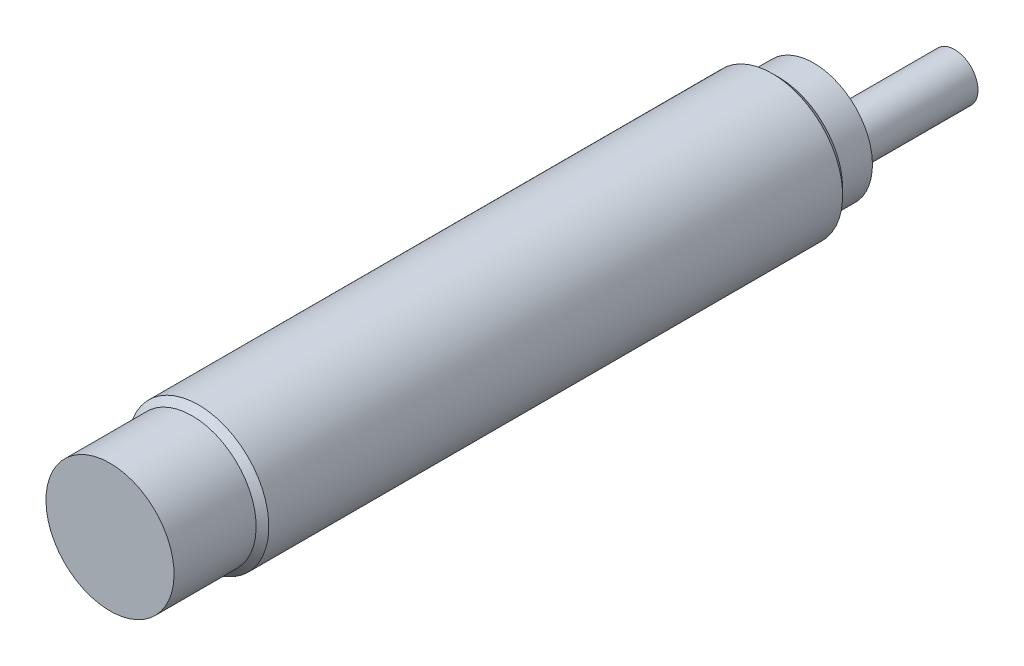
ISO-10303-21;
HEADER;
FILE_DESCRIPTION(('STEP AP214'),'2;1');
FILE_NAME('part.step','',(''),(''),'','','');
FILE_SCHEMA(('AUTOMOTIVE_DESIGN { 1 0 10303 214 1 1 1 1 }'));
ENDSEC;
DATA;
#1=APPLICATION_CONTEXT('core data for automotive mechanical design processes');
#2=APPLICATION_PROTOCOL_DEFINITION('international standard','automotive_design',2000,#1);
#3=PRODUCT_CONTEXT('',#1,'mechanical');
#4=PRODUCT('Part','Part','',(#3));
#5=PRODUCT_RELATED_PRODUCT_CATEGORY('part','',(#4));
#6=PRODUCT_DEFINITION_FORMATION('','',#4);
#7=PRODUCT_DEFINITION_CONTEXT('part definition',#1,'design');
#8=PRODUCT_DEFINITION('design','',#6,#7);
#9=PRODUCT_DEFINITION_SHAPE('','',#8);
#10=(LENGTH_UNIT() NAMED_UNIT(*) SI_UNIT(.MILLI.,.METRE.));
#11=(NAMED_UNIT(*) PLANE_ANGLE_UNIT() SI_UNIT($,.RADIAN.));
#12=(NAMED_UNIT(*) SI_UNIT($,.STERADIAN.) SOLID_ANGLE_UNIT());
#13=UNCERTAINTY_MEASURE_WITH_UNIT(LENGTH_MEASURE(1.E-05),#10,'distance_accuracy_value','');
#14=(GEOMETRIC_REPRESENTATION_CONTEXT(3) GLOBAL_UNCERTAINTY_ASSIGNED_CONTEXT((#13)) GLOBAL_UNIT_ASSIGNED_CONTEXT((#10,
#11,#12)) REPRESENTATION_CONTEXT('',''));
#15=CARTESIAN_POINT('',(0.,0.,0.));
#16=DIRECTION('',(0.,0.,1.));
#17=DIRECTION('',(1.,0.,0.));
#18=AXIS2_PLACEMENT_3D('',#15,#16,#17);
#19=CARTESIAN_POINT('',(0.,5.45875,0.));
#20=DIRECTION('',(0.,0.,1.));
#21=DIRECTION('',(1.,0.,0.));
#22=AXIS2_PLACEMENT_3D('',#19,#20,#21);
#23=PLANE('',#22);
#24=CARTESIAN_POINT('',(0.,0.,0.));
#25=DIRECTION('',(0.,0.,1.));
#26=DIRECTION('',(1.,0.,0.));
#27=AXIS2_PLACEMENT_3D('',#24,#25,#26);
#28=CIRCLE('',#27,5.);
#29=CARTESIAN_POINT('',(5.,0.,0.));
#30=VERTEX_POINT('',#29);
#31=EDGE_CURVE('E45',#30,#30,#28,.T.);
#32=ORIENTED_EDGE('',*,*,#31,.T.);
#33=EDGE_LOOP('',(#32));
#34=FACE_BOUND('',#33,.T.);
#35=CARTESIAN_POINT('',(0.,0.,0.));
#36=DIRECTION('',(0.,0.,-1.));
#37=DIRECTION('',(-1.,0.,0.));
#38=AXIS2_PLACEMENT_3D('',#35,#36,#37);
#39=CIRCLE('',#38,5.45875);
#40=CARTESIAN_POINT('',(-5.45875,0.,0.));
#41=VERTEX_POINT('',#40);
#42=EDGE_CURVE('E42',#41,#41,#39,.T.);
#43=ORIENTED_EDGE('',*,*,#42,.T.);
#44=EDGE_LOOP('',(#43));
#45=FACE_BOUND('',#44,.T.);
#46=ADVANCED_FACE('F17',(#34,#45),#23,.F.);
#47=CARTESIAN_POINT('',(0.,0.,50.));
#48=DIRECTION('',(0.,0.,-1.));
#49=DIRECTION('',(-1.,0.,0.));
#50=AXIS2_PLACEMENT_3D('',#47,#48,#49);
#51=CONICAL_SURFACE('',#50,5.45875,0.785398163397449);
#52=CARTESIAN_POINT('',(0.,0.,49.45875));
#53=DIRECTION('',(0.,0.,-1.));
#54=DIRECTION('',(-1.,0.,0.));
#55=AXIS2_PLACEMENT_3D('',#52,#53,#54);
#56=CIRCLE('',#55,6.);
#57=CARTESIAN_POINT('',(-6.00000000000001,0.,49.45875));
#58=VERTEX_POINT('',#57);
#59=EDGE_CURVE('E24',#58,#58,#56,.T.);
#60=ORIENTED_EDGE('',*,*,#59,.F.);
#61=EDGE_LOOP('',(#60));
#62=FACE_BOUND('',#61,.T.);
#63=CARTESIAN_POINT('',(0.,0.,50.));
#64=DIRECTION('',(0.,0.,1.));
#65=DIRECTION('',(0.,1.,0.));
#66=AXIS2_PLACEMENT_3D('',#63,#64,#65);
#67=CIRCLE('',#66,5.45875);
#68=CARTESIAN_POINT('',(0.,5.45875,50.));
#69=VERTEX_POINT('',#68);
#70=EDGE_CURVE('E67',#69,#69,#67,.T.);
#71=ORIENTED_EDGE('',*,*,#70,.F.);
#72=EDGE_LOOP('',(#71));
#73=FACE_BOUND('',#72,.T.);
#74=ADVANCED_FACE('F74',(#62,#73),#51,.T.);
#75=CARTESIAN_POINT('',(0.,0.,0.));
#76=DIRECTION('',(0.,0.,-1.));
#77=DIRECTION('',(-1.,0.,0.));
#78=AXIS2_PLACEMENT_3D('',#75,#76,#77);
#79=CYLINDRICAL_SURFACE('',#78,6.);
#80=CARTESIAN_POINT('',(0.,0.,0.54125));
#81=DIRECTION('',(0.,0.,-1.));
#82=DIRECTION('',(-1.,0.,0.));
#83=AXIS2_PLACEMENT_3D('',#80,#81,#82);
#84=CIRCLE('',#83,6.);
#85=CARTESIAN_POINT('',(-6.,0.,0.541249999999999));
#86=VERTEX_POINT('',#85);
#87=EDGE_CURVE('E33',#86,#86,#84,.T.);
#88=ORIENTED_EDGE('',*,*,#87,.F.);
#89=EDGE_LOOP('',(#88));
#90=FACE_BOUND('',#89,.T.);
#91=ORIENTED_EDGE('',*,*,#59,.T.);
#92=EDGE_LOOP('',(#91));
#93=FACE_BOUND('',#92,.T.);
#94=ADVANCED_FACE('F76',(#90,#93),#79,.T.);
#95=CARTESIAN_POINT('',(0.,0.,0.54125));
#96=DIRECTION('',(0.,0.,1.));
#97=DIRECTION('',(1.,0.,0.));
#98=AXIS2_PLACEMENT_3D('',#95,#96,#97);
#99=CONICAL_SURFACE('',#98,6.,0.78539816339745);
#100=ORIENTED_EDGE('',*,*,#42,.F.);
#101=EDGE_LOOP('',(#100));
#102=FACE_BOUND('',#101,.T.);
#103=ORIENTED_EDGE('',*,*,#87,.T.);
#104=EDGE_LOOP('',(#103));
#105=FACE_BOUND('',#104,.T.);
#106=ADVANCED_FACE('F83',(#102,#105),#99,.T.);
#107=CARTESIAN_POINT('',(0.,0.,1.));
#108=DIRECTION('',(0.,0.,-1.));
#109=DIRECTION('',(0.,-1.,0.));
#110=AXIS2_PLACEMENT_3D('',#107,#108,#109);
#111=CYLINDRICAL_SURFACE('',#110,5.);
#112=CARTESIAN_POINT('',(0.,0.,-3.));
#113=DIRECTION('',(0.,0.,1.));
#114=DIRECTION('',(0.,-1.,0.));
#115=AXIS2_PLACEMENT_3D('',#112,#113,#114);
#116=CIRCLE('',#115,5.);
#117=CARTESIAN_POINT('',(0.,-5.,-3.));
#118=VERTEX_POINT('',#117);
#119=EDGE_CURVE('E48',#118,#118,#116,.T.);
#120=ORIENTED_EDGE('',*,*,#119,.T.);
#121=EDGE_LOOP('',(#120));
#122=FACE_BOUND('',#121,.T.);
#123=ORIENTED_EDGE('',*,*,#31,.F.);
#124=EDGE_LOOP('',(#123));
#125=FACE_BOUND('',#124,.T.);
#126=ADVANCED_FACE('F89',(#122,#125),#111,.T.);
#127=CARTESIAN_POINT('',(0.,0.,-3.));
#128=DIRECTION('',(0.,0.,-1.));
#129=DIRECTION('',(-1.,0.,0.));
#130=AXIS2_PLACEMENT_3D('',#127,#128,#129);
#131=PLANE('',#130);
#132=CARTESIAN_POINT('',(0.,-2.,-3.));
#133=DIRECTION('',(0.,0.,-1.));
#134=DIRECTION('',(-1.,0.,0.));
#135=AXIS2_PLACEMENT_3D('',#132,#133,#134);
#136=CIRCLE('',#135,2.);
#137=CARTESIAN_POINT('',(-2.,-2.,-3.));
#138=VERTEX_POINT('',#137);
#139=EDGE_CURVE('E10',#138,#138,#136,.T.);
#140=ORIENTED_EDGE('',*,*,#139,.F.);
#141=EDGE_LOOP('',(#140));
#142=FACE_BOUND('',#141,.T.);
#143=ORIENTED_EDGE('',*,*,#119,.F.);
#144=EDGE_LOOP('',(#143));
#145=FACE_BOUND('',#144,.T.);
#146=ADVANCED_FACE('F92',(#142,#145),#131,.T.);
#147=CARTESIAN_POINT('',(0.,-2.,-15.));
#148=DIRECTION('',(0.,0.,-1.));
#149=DIRECTION('',(-1.,0.,0.));
#150=AXIS2_PLACEMENT_3D('',#147,#148,#149);
#151=PLANE('',#150);
#152=CARTESIAN_POINT('',(0.,-2.,-15.));
#153=DIRECTION('',(0.,0.,1.));
#154=DIRECTION('',(0.,-1.,0.));
#155=AXIS2_PLACEMENT_3D('',#152,#153,#154);
#156=CIRCLE('',#155,2.);
#157=CARTESIAN_POINT('',(0.,-4.,-15.));
#158=VERTEX_POINT('',#157);
#159=EDGE_CURVE('E55',#158,#158,#156,.T.);
#160=ORIENTED_EDGE('',*,*,#159,.F.);
#161=EDGE_LOOP('',(#160));
#162=FACE_BOUND('',#161,.T.);
#163=ADVANCED_FACE('F95',(#162),#151,.T.);
#164=CARTESIAN_POINT('',(0.,-2.,1.));
#165=DIRECTION('',(0.,0.,-1.));
#166=DIRECTION('',(0.,-1.,0.));
#167=AXIS2_PLACEMENT_3D('',#164,#165,#166);
#168=CYLINDRICAL_SURFACE('',#167,2.);
#169=ORIENTED_EDGE('',*,*,#139,.T.);
#170=EDGE_LOOP('',(#169));
#171=FACE_BOUND('',#170,.T.);
#172=ORIENTED_EDGE('',*,*,#159,.T.);
#173=EDGE_LOOP('',(#172));
#174=FACE_BOUND('',#173,.T.);
#175=ADVANCED_FACE('F97',(#171,#174),#168,.T.);
#176=CARTESIAN_POINT('',(0.,0.,57.));
#177=DIRECTION('',(0.,0.,1.));
#178=DIRECTION('',(1.,0.,0.));
#179=AXIS2_PLACEMENT_3D('',#176,#177,#178);
#180=PLANE('',#179);
#181=CARTESIAN_POINT('',(0.,0.,57.));
#182=DIRECTION('',(0.,0.,-1.));
#183=DIRECTION('',(0.,1.,0.));
#184=AXIS2_PLACEMENT_3D('',#181,#182,#183);
#185=CIRCLE('',#184,5.45875);
#186=CARTESIAN_POINT('',(0.,5.45875,57.));
#187=VERTEX_POINT('',#186);
#188=EDGE_CURVE('E61',#187,#187,#185,.T.);
#189=ORIENTED_EDGE('',*,*,#188,.F.);
#190=EDGE_LOOP('',(#189));
#191=FACE_BOUND('',#190,.T.);
#192=ADVANCED_FACE('F100',(#191),#180,.T.);
#193=CARTESIAN_POINT('',(0.,0.,50.));
#194=DIRECTION('',(0.,0.,1.));
#195=DIRECTION('',(0.,1.,0.));
#196=AXIS2_PLACEMENT_3D('',#193,#194,#195);
#197=CYLINDRICAL_SURFACE('',#196,5.45875);
#198=ORIENTED_EDGE('',*,*,#188,.T.);
#199=EDGE_LOOP('',(#198));
#200=FACE_BOUND('',#199,.T.);
#201=ORIENTED_EDGE('',*,*,#70,.T.);
#202=EDGE_LOOP('',(#201));
#203=FACE_BOUND('',#202,.T.);
#204=ADVANCED_FACE('F72',(#200,#203),#197,.T.);
#205=CLOSED_SHELL('',(#46,#74,#94,#106,#126,#146,#163,#175,#192,#204));
#206=MANIFOLD_SOLID_BREP('B1',#205);
#207=ADVANCED_BREP_SHAPE_REPRESENTATION('',(#18,#206),#14);
#208=SHAPE_DEFINITION_REPRESENTATION(#9,#207);
ENDSEC;
END-ISO-10303-21;
